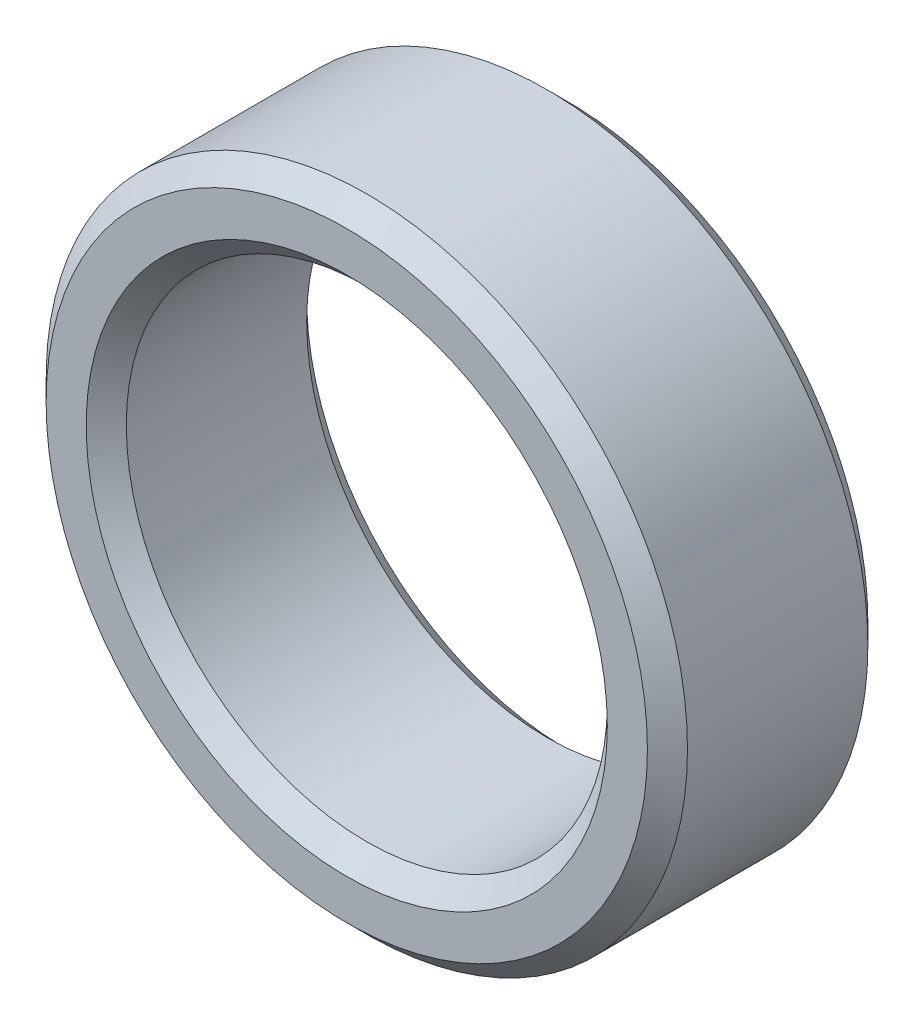
ISO-10303-21;
HEADER;
FILE_DESCRIPTION(('STEP AP214'),'2;1');
FILE_NAME('part.step','',(''),(''),'','','');
FILE_SCHEMA(('AUTOMOTIVE_DESIGN { 1 0 10303 214 1 1 1 1 }'));
ENDSEC;
DATA;
#1=APPLICATION_CONTEXT('core data for automotive mechanical design processes');
#2=APPLICATION_PROTOCOL_DEFINITION('international standard','automotive_design',2000,#1);
#3=PRODUCT_CONTEXT('',#1,'mechanical');
#4=PRODUCT('Part','Part','',(#3));
#5=PRODUCT_RELATED_PRODUCT_CATEGORY('part','',(#4));
#6=PRODUCT_DEFINITION_FORMATION('','',#4);
#7=PRODUCT_DEFINITION_CONTEXT('part definition',#1,'design');
#8=PRODUCT_DEFINITION('design','',#6,#7);
#9=PRODUCT_DEFINITION_SHAPE('','',#8);
#10=(LENGTH_UNIT() NAMED_UNIT(*) SI_UNIT(.MILLI.,.METRE.));
#11=(NAMED_UNIT(*) PLANE_ANGLE_UNIT() SI_UNIT($,.RADIAN.));
#12=(NAMED_UNIT(*) SI_UNIT($,.STERADIAN.) SOLID_ANGLE_UNIT());
#13=UNCERTAINTY_MEASURE_WITH_UNIT(LENGTH_MEASURE(1.E-05),#10,'distance_accuracy_value','');
#14=(GEOMETRIC_REPRESENTATION_CONTEXT(3) GLOBAL_UNCERTAINTY_ASSIGNED_CONTEXT((#13)) GLOBAL_UNIT_ASSIGNED_CONTEXT((#10,
#11,#12)) REPRESENTATION_CONTEXT('',''));
#15=CARTESIAN_POINT('',(0.,0.,0.));
#16=DIRECTION('',(0.,0.,1.));
#17=DIRECTION('',(1.,0.,0.));
#18=AXIS2_PLACEMENT_3D('',#15,#16,#17);
#19=CARTESIAN_POINT('',(0.,0.,5.5));
#20=DIRECTION('',(0.,0.,1.));
#21=DIRECTION('',(1.,0.,0.));
#22=AXIS2_PLACEMENT_3D('',#19,#20,#21);
#23=PLANE('',#22);
#24=CARTESIAN_POINT('',(0.,0.,5.5));
#25=DIRECTION('',(0.,0.,1.));
#26=DIRECTION('',(1.,0.,0.));
#27=AXIS2_PLACEMENT_3D('',#24,#25,#26);
#28=CIRCLE('',#27,6.50000000000001);
#29=CARTESIAN_POINT('',(6.50000000000001,0.,5.5));
#30=VERTEX_POINT('',#29);
#31=EDGE_CURVE('E52',#30,#30,#28,.F.);
#32=ORIENTED_EDGE('',*,*,#31,.T.);
#33=EDGE_LOOP('',(#32));
#34=FACE_BOUND('',#33,.T.);
#35=CARTESIAN_POINT('',(0.,0.,5.5));
#36=DIRECTION('',(0.,0.,1.));
#37=DIRECTION('',(1.,0.,0.));
#38=AXIS2_PLACEMENT_3D('',#35,#36,#37);
#39=CIRCLE('',#38,7.5);
#40=CARTESIAN_POINT('',(7.5,0.,5.5));
#41=VERTEX_POINT('',#40);
#42=EDGE_CURVE('E55',#41,#41,#39,.T.);
#43=ORIENTED_EDGE('',*,*,#42,.T.);
#44=EDGE_LOOP('',(#43));
#45=FACE_BOUND('',#44,.T.);
#46=ADVANCED_FACE('F32',(#34,#45),#23,.T.);
#47=CARTESIAN_POINT('',(0.,0.,0.));
#48=DIRECTION('',(0.,0.,1.));
#49=DIRECTION('',(1.,0.,0.));
#50=AXIS2_PLACEMENT_3D('',#47,#48,#49);
#51=PLANE('',#50);
#52=CARTESIAN_POINT('',(0.,0.,0.));
#53=DIRECTION('',(0.,0.,1.));
#54=DIRECTION('',(1.,0.,0.));
#55=AXIS2_PLACEMENT_3D('',#52,#53,#54);
#56=CIRCLE('',#55,6.5);
#57=CARTESIAN_POINT('',(6.5,0.,0.));
#58=VERTEX_POINT('',#57);
#59=EDGE_CURVE('E10',#58,#58,#56,.T.);
#60=ORIENTED_EDGE('',*,*,#59,.T.);
#61=EDGE_LOOP('',(#60));
#62=FACE_BOUND('',#61,.T.);
#63=CARTESIAN_POINT('',(0.,0.,0.));
#64=DIRECTION('',(0.,0.,1.));
#65=DIRECTION('',(1.,0.,0.));
#66=AXIS2_PLACEMENT_3D('',#63,#64,#65);
#67=CIRCLE('',#66,7.5);
#68=CARTESIAN_POINT('',(7.5,0.,0.));
#69=VERTEX_POINT('',#68);
#70=EDGE_CURVE('E39',#69,#69,#67,.F.);
#71=ORIENTED_EDGE('',*,*,#70,.T.);
#72=EDGE_LOOP('',(#71));
#73=FACE_BOUND('',#72,.T.);
#74=ADVANCED_FACE('F80',(#62,#73),#51,.F.);
#75=CARTESIAN_POINT('',(0.,0.,5.5));
#76=DIRECTION('',(0.,0.,-1.));
#77=DIRECTION('',(-1.,0.,0.));
#78=AXIS2_PLACEMENT_3D('',#75,#76,#77);
#79=CYLINDRICAL_SURFACE('',#78,8.);
#80=CARTESIAN_POINT('',(0.,0.,4.99999999999999));
#81=DIRECTION('',(0.,0.,1.));
#82=DIRECTION('',(1.,0.,0.));
#83=AXIS2_PLACEMENT_3D('',#80,#81,#82);
#84=CIRCLE('',#83,8.);
#85=CARTESIAN_POINT('',(8.,0.,4.99999999999999));
#86=VERTEX_POINT('',#85);
#87=EDGE_CURVE('E43',#86,#86,#84,.F.);
#88=ORIENTED_EDGE('',*,*,#87,.T.);
#89=EDGE_LOOP('',(#88));
#90=FACE_BOUND('',#89,.T.);
#91=CARTESIAN_POINT('',(0.,0.,0.5));
#92=DIRECTION('',(0.,0.,1.));
#93=DIRECTION('',(1.,0.,0.));
#94=AXIS2_PLACEMENT_3D('',#91,#92,#93);
#95=CIRCLE('',#94,8.);
#96=CARTESIAN_POINT('',(8.,0.,0.5));
#97=VERTEX_POINT('',#96);
#98=EDGE_CURVE('E47',#97,#97,#95,.T.);
#99=ORIENTED_EDGE('',*,*,#98,.T.);
#100=EDGE_LOOP('',(#99));
#101=FACE_BOUND('',#100,.T.);
#102=ADVANCED_FACE('F86',(#90,#101),#79,.T.);
#103=CARTESIAN_POINT('',(0.,0.,5.5));
#104=DIRECTION('',(0.,0.,-1.));
#105=DIRECTION('',(-1.,0.,0.));
#106=AXIS2_PLACEMENT_3D('',#103,#104,#105);
#107=CYLINDRICAL_SURFACE('',#106,6.);
#108=CARTESIAN_POINT('',(0.,0.,4.99999999999999));
#109=DIRECTION('',(0.,0.,1.));
#110=DIRECTION('',(1.,0.,0.));
#111=AXIS2_PLACEMENT_3D('',#108,#109,#110);
#112=CIRCLE('',#111,6.);
#113=CARTESIAN_POINT('',(6.,0.,4.99999999999999));
#114=VERTEX_POINT('',#113);
#115=EDGE_CURVE('E58',#114,#114,#112,.T.);
#116=ORIENTED_EDGE('',*,*,#115,.T.);
#117=EDGE_LOOP('',(#116));
#118=FACE_BOUND('',#117,.T.);
#119=CARTESIAN_POINT('',(0.,0.,0.5));
#120=DIRECTION('',(0.,0.,1.));
#121=DIRECTION('',(1.,0.,0.));
#122=AXIS2_PLACEMENT_3D('',#119,#120,#121);
#123=CIRCLE('',#122,6.);
#124=CARTESIAN_POINT('',(6.,0.,0.5));
#125=VERTEX_POINT('',#124);
#126=EDGE_CURVE('E61',#125,#125,#123,.F.);
#127=ORIENTED_EDGE('',*,*,#126,.T.);
#128=EDGE_LOOP('',(#127));
#129=FACE_BOUND('',#128,.T.);
#130=ADVANCED_FACE('F65',(#118,#129),#107,.F.);
#131=CARTESIAN_POINT('',(0.,0.,4.99999999999999));
#132=DIRECTION('',(0.,0.,1.));
#133=DIRECTION('',(1.,0.,0.));
#134=AXIS2_PLACEMENT_3D('',#131,#132,#133);
#135=CONICAL_SURFACE('',#134,6.,0.785398163397449);
#136=ORIENTED_EDGE('',*,*,#31,.F.);
#137=EDGE_LOOP('',(#136));
#138=FACE_BOUND('',#137,.T.);
#139=ORIENTED_EDGE('',*,*,#115,.F.);
#140=EDGE_LOOP('',(#139));
#141=FACE_BOUND('',#140,.T.);
#142=ADVANCED_FACE('F76',(#138,#141),#135,.F.);
#143=CARTESIAN_POINT('',(0.,0.,5.5));
#144=DIRECTION('',(0.,0.,-1.));
#145=DIRECTION('',(-1.,0.,0.));
#146=AXIS2_PLACEMENT_3D('',#143,#144,#145);
#147=CONICAL_SURFACE('',#146,7.5,0.785398163397447);
#148=ORIENTED_EDGE('',*,*,#87,.F.);
#149=EDGE_LOOP('',(#148));
#150=FACE_BOUND('',#149,.T.);
#151=ORIENTED_EDGE('',*,*,#42,.F.);
#152=EDGE_LOOP('',(#151));
#153=FACE_BOUND('',#152,.T.);
#154=ADVANCED_FACE('F70',(#150,#153),#147,.T.);
#155=CARTESIAN_POINT('',(0.,0.,0.));
#156=DIRECTION('',(0.,0.,-1.));
#157=DIRECTION('',(-1.,0.,0.));
#158=AXIS2_PLACEMENT_3D('',#155,#156,#157);
#159=CONICAL_SURFACE('',#158,6.5,0.785398163397447);
#160=ORIENTED_EDGE('',*,*,#126,.F.);
#161=EDGE_LOOP('',(#160));
#162=FACE_BOUND('',#161,.T.);
#163=ORIENTED_EDGE('',*,*,#59,.F.);
#164=EDGE_LOOP('',(#163));
#165=FACE_BOUND('',#164,.T.);
#166=ADVANCED_FACE('F67',(#162,#165),#159,.F.);
#167=CARTESIAN_POINT('',(0.,0.,0.5));
#168=DIRECTION('',(0.,0.,1.));
#169=DIRECTION('',(1.,0.,0.));
#170=AXIS2_PLACEMENT_3D('',#167,#168,#169);
#171=CONICAL_SURFACE('',#170,8.,0.785398163397448);
#172=ORIENTED_EDGE('',*,*,#70,.F.);
#173=EDGE_LOOP('',(#172));
#174=FACE_BOUND('',#173,.T.);
#175=ORIENTED_EDGE('',*,*,#98,.F.);
#176=EDGE_LOOP('',(#175));
#177=FACE_BOUND('',#176,.T.);
#178=ADVANCED_FACE('F34',(#174,#177),#171,.T.);
#179=CLOSED_SHELL('',(#46,#74,#102,#130,#142,#154,#166,#178));
#180=MANIFOLD_SOLID_BREP('B2',#179);
#181=ADVANCED_BREP_SHAPE_REPRESENTATION('',(#18,#180),#14);
#182=SHAPE_DEFINITION_REPRESENTATION(#9,#181);
ENDSEC;
END-ISO-10303-21;
